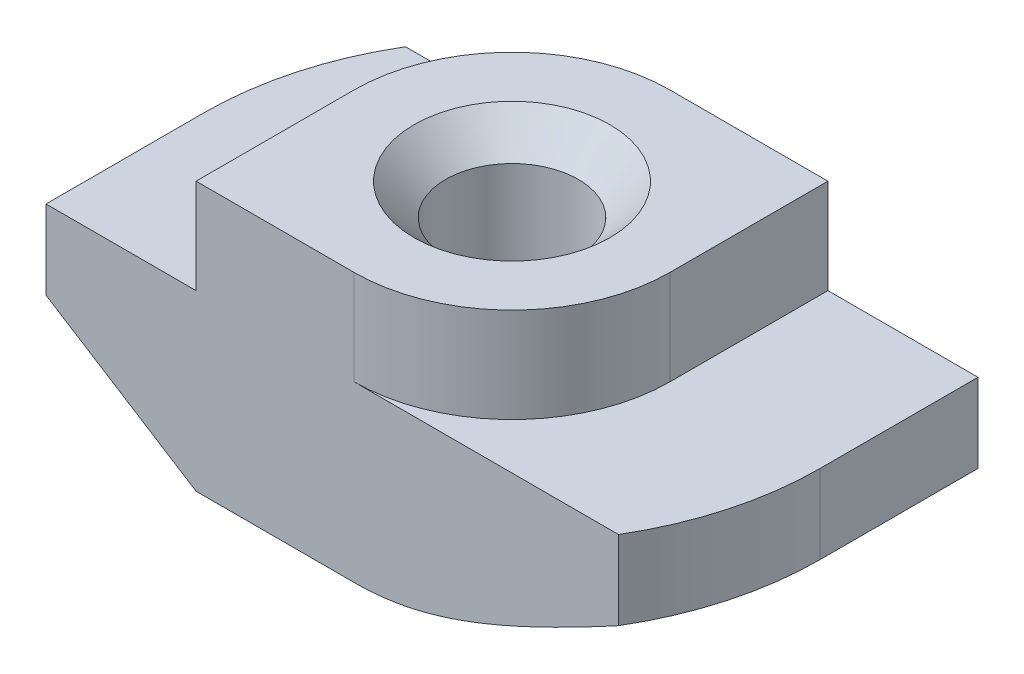
ISO-10303-21;
HEADER;
FILE_DESCRIPTION(('STEP AP214'),'2;1');
FILE_NAME('part.step','',(''),(''),'','','');
FILE_SCHEMA(('AUTOMOTIVE_DESIGN { 1 0 10303 214 1 1 1 1 }'));
ENDSEC;
DATA;
#1=APPLICATION_CONTEXT('core data for automotive mechanical design processes');
#2=APPLICATION_PROTOCOL_DEFINITION('international standard','automotive_design',2000,#1);
#3=PRODUCT_CONTEXT('',#1,'mechanical');
#4=PRODUCT('Part','Part','',(#3));
#5=PRODUCT_RELATED_PRODUCT_CATEGORY('part','',(#4));
#6=PRODUCT_DEFINITION_FORMATION('','',#4);
#7=PRODUCT_DEFINITION_CONTEXT('part definition',#1,'design');
#8=PRODUCT_DEFINITION('design','',#6,#7);
#9=PRODUCT_DEFINITION_SHAPE('','',#8);
#10=(LENGTH_UNIT() NAMED_UNIT(*) SI_UNIT(.MILLI.,.METRE.));
#11=(NAMED_UNIT(*) PLANE_ANGLE_UNIT() SI_UNIT($,.RADIAN.));
#12=(NAMED_UNIT(*) SI_UNIT($,.STERADIAN.) SOLID_ANGLE_UNIT());
#13=UNCERTAINTY_MEASURE_WITH_UNIT(LENGTH_MEASURE(1.E-05),#10,'distance_accuracy_value','');
#14=(GEOMETRIC_REPRESENTATION_CONTEXT(3) GLOBAL_UNCERTAINTY_ASSIGNED_CONTEXT((#13)) GLOBAL_UNIT_ASSIGNED_CONTEXT((#10,
#11,#12)) REPRESENTATION_CONTEXT('',''));
#15=CARTESIAN_POINT('',(0.,0.,0.));
#16=DIRECTION('',(0.,0.,1.));
#17=DIRECTION('',(1.,0.,0.));
#18=AXIS2_PLACEMENT_3D('',#15,#16,#17);
#19=CARTESIAN_POINT('',(-9.75,-3.,5.));
#20=DIRECTION('',(1.,0.,0.));
#21=DIRECTION('',(0.,1.,0.));
#22=AXIS2_PLACEMENT_3D('',#19,#20,#21);
#23=PLANE('',#22);
#24=DIRECTION('',(0.,0.,-1.));
#25=VECTOR('',#24,1.);
#26=CARTESIAN_POINT('',(-9.75,-5.5,5.));
#27=LINE('',#26,#25);
#28=CARTESIAN_POINT('',(-9.75,-5.5,5.));
#29=VERTEX_POINT('',#28);
#30=CARTESIAN_POINT('',(-9.75,-5.5,0.));
#31=VERTEX_POINT('',#30);
#32=EDGE_CURVE('E316',#29,#31,#27,.T.);
#33=ORIENTED_EDGE('',*,*,#32,.F.);
#34=DIRECTION('',(0.,-1.,0.));
#35=VECTOR('',#34,1.);
#36=CARTESIAN_POINT('',(-9.75,-3.,5.));
#37=LINE('',#36,#35);
#38=CARTESIAN_POINT('',(-9.75,-3.,5.));
#39=VERTEX_POINT('',#38);
#40=EDGE_CURVE('E163',#39,#29,#37,.T.);
#41=ORIENTED_EDGE('',*,*,#40,.F.);
#42=DIRECTION('',(0.,0.,-1.));
#43=VECTOR('',#42,1.);
#44=CARTESIAN_POINT('',(-9.75,-3.,5.));
#45=LINE('',#44,#43);
#46=CARTESIAN_POINT('',(-9.75,-3.,0.));
#47=VERTEX_POINT('',#46);
#48=EDGE_CURVE('E45',#39,#47,#45,.T.);
#49=ORIENTED_EDGE('',*,*,#48,.T.);
#50=DIRECTION('',(0.,1.,0.));
#51=VECTOR('',#50,1.);
#52=CARTESIAN_POINT('',(-9.75,-8.5,0.));
#53=LINE('',#52,#51);
#54=EDGE_CURVE('E209',#31,#47,#53,.T.);
#55=ORIENTED_EDGE('',*,*,#54,.F.);
#56=EDGE_LOOP('',(#33,#41,#49,#55));
#57=FACE_BOUND('',#56,.T.);
#58=ADVANCED_FACE('F37',(#57),#23,.F.);
#59=CARTESIAN_POINT('',(-9.75,-8.5,5.));
#60=DIRECTION('',(0.,1.,0.));
#61=DIRECTION('',(0.,0.,1.));
#62=AXIS2_PLACEMENT_3D('',#59,#60,#61);
#63=PLANE('',#62);
#64=CARTESIAN_POINT('',(0.,-8.5,0.));
#65=DIRECTION('',(0.,1.,0.));
#66=DIRECTION('',(0.,0.,1.));
#67=AXIS2_PLACEMENT_3D('',#64,#65,#66);
#68=CIRCLE('',#67,3.1);
#69=CARTESIAN_POINT('',(0.,-8.5,3.1));
#70=VERTEX_POINT('',#69);
#71=EDGE_CURVE('E258',#70,#70,#68,.T.);
#72=ORIENTED_EDGE('',*,*,#71,.T.);
#73=EDGE_LOOP('',(#72));
#74=FACE_BOUND('',#73,.T.);
#75=DIRECTION('',(1.,0.,0.));
#76=VECTOR('',#75,1.);
#77=CARTESIAN_POINT('',(-9.75,-8.5,5.));
#78=LINE('',#77,#76);
#79=CARTESIAN_POINT('',(-5.,-8.5,5.));
#80=VERTEX_POINT('',#79);
#81=CARTESIAN_POINT('',(0.,-8.5,5.));
#82=VERTEX_POINT('',#81);
#83=EDGE_CURVE('E161',#80,#82,#78,.T.);
#84=ORIENTED_EDGE('',*,*,#83,.F.);
#85=DIRECTION('',(0.,0.,-1.));
#86=VECTOR('',#85,1.);
#87=CARTESIAN_POINT('',(-5.,-8.5,5.));
#88=LINE('',#87,#86);
#89=CARTESIAN_POINT('',(-5.,-8.5,0.));
#90=VERTEX_POINT('',#89);
#91=EDGE_CURVE('E146',#80,#90,#88,.T.);
#92=ORIENTED_EDGE('',*,*,#91,.T.);
#93=CARTESIAN_POINT('',(0.,-8.5,0.));
#94=DIRECTION('',(0.,-1.,0.));
#95=DIRECTION('',(-1.,0.,0.));
#96=AXIS2_PLACEMENT_3D('',#93,#94,#95);
#97=CIRCLE('',#96,5.);
#98=CARTESIAN_POINT('',(0.,-8.5,-5.));
#99=VERTEX_POINT('',#98);
#100=EDGE_CURVE('E317',#90,#99,#97,.T.);
#101=ORIENTED_EDGE('',*,*,#100,.T.);
#102=DIRECTION('',(1.,0.,0.));
#103=VECTOR('',#102,1.);
#104=CARTESIAN_POINT('',(-9.75,-8.5,-5.));
#105=LINE('',#104,#103);
#106=CARTESIAN_POINT('',(5.,-8.5,-5.));
#107=VERTEX_POINT('',#106);
#108=EDGE_CURVE('E181',#99,#107,#105,.T.);
#109=ORIENTED_EDGE('',*,*,#108,.T.);
#110=DIRECTION('',(0.,0.,1.));
#111=VECTOR('',#110,1.);
#112=CARTESIAN_POINT('',(5.,-8.5,-9.75));
#113=LINE('',#112,#111);
#114=CARTESIAN_POINT('',(5.,-8.5,0.));
#115=VERTEX_POINT('',#114);
#116=EDGE_CURVE('E52',#107,#115,#113,.T.);
#117=ORIENTED_EDGE('',*,*,#116,.T.);
#118=CARTESIAN_POINT('',(0.,-8.5,0.));
#119=DIRECTION('',(0.,-1.,0.));
#120=DIRECTION('',(1.,0.,0.));
#121=AXIS2_PLACEMENT_3D('',#118,#119,#120);
#122=CIRCLE('',#121,5.);
#123=EDGE_CURVE('E167',#115,#82,#122,.T.);
#124=ORIENTED_EDGE('',*,*,#123,.T.);
#125=EDGE_LOOP('',(#84,#92,#101,#109,#117,#124));
#126=FACE_BOUND('',#125,.T.);
#127=ADVANCED_FACE('F166',(#74,#126),#63,.F.);
#128=CARTESIAN_POINT('',(9.75,-3.,5.));
#129=DIRECTION('',(-1.,0.,0.));
#130=DIRECTION('',(0.,-1.,0.));
#131=AXIS2_PLACEMENT_3D('',#128,#129,#130);
#132=PLANE('',#131);
#133=DIRECTION('',(0.,0.,1.));
#134=VECTOR('',#133,1.);
#135=CARTESIAN_POINT('',(9.75,-5.5,-9.75));
#136=LINE('',#135,#134);
#137=CARTESIAN_POINT('',(9.75,-5.5,-5.));
#138=VERTEX_POINT('',#137);
#139=CARTESIAN_POINT('',(9.75,-5.5,0.));
#140=VERTEX_POINT('',#139);
#141=EDGE_CURVE('E304',#138,#140,#136,.T.);
#142=ORIENTED_EDGE('',*,*,#141,.F.);
#143=DIRECTION('',(0.,1.,0.));
#144=VECTOR('',#143,1.);
#145=CARTESIAN_POINT('',(9.75,-3.,-5.));
#146=LINE('',#145,#144);
#147=CARTESIAN_POINT('',(9.75,-3.,-5.));
#148=VERTEX_POINT('',#147);
#149=EDGE_CURVE('E185',#138,#148,#146,.T.);
#150=ORIENTED_EDGE('',*,*,#149,.T.);
#151=DIRECTION('',(0.,0.,-1.));
#152=VECTOR('',#151,1.);
#153=CARTESIAN_POINT('',(9.75,-3.,5.));
#154=LINE('',#153,#152);
#155=CARTESIAN_POINT('',(9.75,-3.,0.));
#156=VERTEX_POINT('',#155);
#157=EDGE_CURVE('E203',#156,#148,#154,.T.);
#158=ORIENTED_EDGE('',*,*,#157,.F.);
#159=DIRECTION('',(0.,1.,0.));
#160=VECTOR('',#159,1.);
#161=CARTESIAN_POINT('',(9.75,-8.5,0.));
#162=LINE('',#161,#160);
#163=EDGE_CURVE('E220',#140,#156,#162,.T.);
#164=ORIENTED_EDGE('',*,*,#163,.F.);
#165=EDGE_LOOP('',(#142,#150,#158,#164));
#166=FACE_BOUND('',#165,.T.);
#167=ADVANCED_FACE('F303',(#166),#132,.F.);
#168=CARTESIAN_POINT('',(0.,0.,5.));
#169=DIRECTION('',(0.,0.,-1.));
#170=DIRECTION('',(-1.,0.,0.));
#171=AXIS2_PLACEMENT_3D('',#168,#169,#170);
#172=PLANE('',#171);
#173=DIRECTION('',(-0.845488903030971,0.533992991387982,0.));
#174=VECTOR('',#173,1.);
#175=CARTESIAN_POINT('',(-5.,-8.5,5.));
#176=LINE('',#175,#174);
#177=EDGE_CURVE('E149',#80,#29,#176,.T.);
#178=ORIENTED_EDGE('',*,*,#177,.F.);
#179=ORIENTED_EDGE('',*,*,#83,.T.);
#180=CARTESIAN_POINT('',(17.262244143281,-0.307293389432442,5.));
#181=CARTESIAN_POINT('',(16.9181308600236,-0.516038873305145,5.));
#182=CARTESIAN_POINT('',(16.5738102897848,-0.724443579056905,5.));
#183=CARTESIAN_POINT('',(15.8846572648478,-1.14040949764273,5.));
#184=CARTESIAN_POINT('',(15.5398248070583,-1.34797070535434,5.));
#185=CARTESIAN_POINT('',(14.849449183752,-1.76214855860734,5.));
#186=CARTESIAN_POINT('',(14.5039058329425,-1.96876489545256,5.));
#187=CARTESIAN_POINT('',(13.8120865339308,-2.38076637630233,5.));
#188=CARTESIAN_POINT('',(13.4658105873009,-2.58615152294555,5.));
#189=CARTESIAN_POINT('',(12.7701257444387,-2.9967235767826,5.));
#190=CARTESIAN_POINT('',(12.4207110467127,-3.20190066061248,5.));
#191=CARTESIAN_POINT('',(11.7207559725619,-3.61032570435187,5.));
#192=CARTESIAN_POINT('',(11.3702155989535,-3.81357366908299,5.));
#193=CARTESIAN_POINT('',(10.6677796822931,-4.21757158257786,5.));
#194=CARTESIAN_POINT('',(10.3158843909765,-4.41832196857919,5.));
#195=CARTESIAN_POINT('',(9.61028766235045,-4.81662297884814,5.));
#196=CARTESIAN_POINT('',(9.25658624442202,-5.01417363735639,5.));
#197=CARTESIAN_POINT('',(8.67651884482225,-5.33358875947317,5.));
#198=CARTESIAN_POINT('',(8.45085586286926,-5.45672933011883,5.));
#199=CARTESIAN_POINT('',(7.99839816596211,-5.7009118245922,5.));
#200=CARTESIAN_POINT('',(7.7716034613976,-5.82195376764063,5.));
#201=CARTESIAN_POINT('',(7.31656550307167,-6.06150930978857,5.));
#202=CARTESIAN_POINT('',(7.08832171147009,-6.18002188913812,5.));
#203=CARTESIAN_POINT('',(6.63019586788231,-6.4138387855286,5.));
#204=CARTESIAN_POINT('',(6.40031383435597,-6.52914313864854,5.));
#205=CARTESIAN_POINT('',(5.93820478281431,-6.75588727170323,5.));
#206=CARTESIAN_POINT('',(5.7059746936284,-6.86732081363046,5.));
#207=CARTESIAN_POINT('',(5.23907645564551,-7.08502278555658,5.));
#208=CARTESIAN_POINT('',(5.00440814785845,-7.19129087613112,5.));
#209=CARTESIAN_POINT('',(4.53226065346344,-7.39709096715067,5.));
#210=CARTESIAN_POINT('',(4.29478297028451,-7.49662639457186,5.));
#211=CARTESIAN_POINT('',(3.81637192229998,-7.68696585333208,5.));
#212=CARTESIAN_POINT('',(3.5754391700731,-7.77777141099744,5.));
#213=CARTESIAN_POINT('',(3.0666504277393,-7.95599282874955,5.));
#214=CARTESIAN_POINT('',(2.79839541579213,-8.04228449542548,5.));
#215=CARTESIAN_POINT('',(2.2565574894892,-8.19664810960895,5.));
#216=CARTESIAN_POINT('',(1.98297506296302,-8.26472171700009,5.));
#217=CARTESIAN_POINT('',(1.57048018943482,-8.34889725118016,5.));
#218=CARTESIAN_POINT('',(1.43336340824762,-8.37388041638201,5.));
#219=CARTESIAN_POINT('',(1.15813012493196,-8.41748641658561,5.));
#220=CARTESIAN_POINT('',(1.02001377745311,-8.436110214877,5.));
#221=CARTESIAN_POINT('',(0.743060652147379,-8.46647997898083,5.));
#222=CARTESIAN_POINT('',(0.604224087141818,-8.47822787147193,5.));
#223=CARTESIAN_POINT('',(0.326124948003932,-8.49449788273713,5.));
#224=CARTESIAN_POINT('',(0.186862377229114,-8.4990200583135,5.));
#225=CARTESIAN_POINT('',(-0.0922407847681702,-8.50069722270995,5.));
#226=CARTESIAN_POINT('',(-0.232081548334554,-8.49782394939686,5.));
#227=CARTESIAN_POINT('',(-0.511416983097128,-8.48474358023713,5.));
#228=CARTESIAN_POINT('',(-0.650911651522947,-8.47453642587413,5.));
#229=CARTESIAN_POINT('',(-0.929240782372286,-8.44710081868491,5.));
#230=CARTESIAN_POINT('',(-1.06807506182894,-8.42987052298589,5.));
#231=CARTESIAN_POINT('',(-1.34478468003669,-8.38888095808797,5.));
#232=CARTESIAN_POINT('',(-1.48265986658218,-8.36512067578682,5.));
#233=CARTESIAN_POINT('',(-1.89959043169188,-8.28395489226572,5.));
#234=CARTESIAN_POINT('',(-2.17684565694345,-8.21720360210331,5.));
#235=CARTESIAN_POINT('',(-2.72589170638494,-8.06457588389501,5.));
#236=CARTESIAN_POINT('',(-2.99768197912353,-7.97869753625189,5.));
#237=CARTESIAN_POINT('',(-3.51935741319823,-7.79847300649859,5.));
#238=CARTESIAN_POINT('',(-3.76954704201942,-7.70499615425147,5.));
#239=CARTESIAN_POINT('',(-4.26618103118316,-7.50852092270228,5.));
#240=CARTESIAN_POINT('',(-4.51262461455279,-7.40552059867213,5.));
#241=CARTESIAN_POINT('',(-5.00262192827966,-7.19219327582968,5.));
#242=CARTESIAN_POINT('',(-5.24617216747364,-7.08185831308792,5.));
#243=CARTESIAN_POINT('',(-5.73065462411407,-6.85565949095677,5.));
#244=CARTESIAN_POINT('',(-5.97158705304315,-6.73979608232788,5.));
#245=CARTESIAN_POINT('',(-6.43818954732616,-6.5102320811199,5.));
#246=CARTESIAN_POINT('',(-6.66397276848694,-6.39676061738702,5.));
#247=CARTESIAN_POINT('',(-7.11397427522263,-6.16674600104322,5.));
#248=CARTESIAN_POINT('',(-7.33819251414361,-6.05020275734948,5.));
#249=CARTESIAN_POINT('',(-7.78462128962769,-5.81501515861086,5.));
#250=CARTESIAN_POINT('',(-8.00683592168321,-5.69637855963136,5.));
#251=CARTESIAN_POINT('',(-8.45015187326331,-5.45708859393409,5.));
#252=CARTESIAN_POINT('',(-8.67125329033443,-5.3364354080695,5.));
#253=CARTESIAN_POINT('',(-8.89190962188937,-5.21498281447114,5.));
#254=B_SPLINE_CURVE_WITH_KNOTS('',3,(#180,#181,#182,#183,#184,#185,#186,#187,#188,#189,#190,
#191,#192,#193,#194,#195,#196,#197,#198,#199,#200,#201,#202,#203,#204,#205,#206,#207,#208,#209,
#210,#211,#212,#213,#214,#215,#216,#217,#218,#219,#220,#221,#222,#223,#224,#225,#226,#227,#228,
#229,#230,#231,#232,#233,#234,#235,#236,#237,#238,#239,#240,#241,#242,#243,#244,#245,#246,#247,
#248,#249,#250,#251,#252,#253),.UNSPECIFIED.,.F.,.F.,(4,2,2,2,2,2,2,2,2,2,2,2,2,2,2,2,2,2,2,2,2,
2,2,2,2,2,2,2,2,2,2,2,2,2,2,2,4),(0.,1.2074348525902,2.41487702685636,3.6226889318846,
4.83049824742936,6.04609801107066,7.26169473565424,8.47707556989018,9.6924433896013,
10.4636587366001,11.2348670165302,12.0063805610561,12.7778854258001,13.5505808046002,
14.3233268891437,15.0956766332549,15.8678910935751,16.712814547319,17.5576609921784,
17.9756593894318,18.3935944419621,18.8114123299238,19.2292269333493,19.6486406079805,
20.0680576291127,20.4875847762243,20.9071770481351,21.7617047407382,22.6163182326723,
23.4173126374625,24.2184709710381,25.0205138758327,25.8224914976274,26.5805429248652,
27.3386168547938,28.0943078892628,28.8499315110688),.UNSPECIFIED.);
#255=CARTESIAN_POINT('',(8.3703345213916,-5.5,5.));
#256=VERTEX_POINT('',#255);
#257=EDGE_CURVE('E321',#256,#82,#254,.T.);
#258=ORIENTED_EDGE('',*,*,#257,.F.);
#259=DIRECTION('',(0.,1.,0.));
#260=VECTOR('',#259,1.);
#261=CARTESIAN_POINT('',(8.37033452139161,-8.5,5.));
#262=LINE('',#261,#260);
#263=CARTESIAN_POINT('',(8.37033452139161,-3.,5.));
#264=VERTEX_POINT('',#263);
#265=EDGE_CURVE('E223',#256,#264,#262,.T.);
#266=ORIENTED_EDGE('',*,*,#265,.T.);
#267=DIRECTION('',(-1.,0.,0.));
#268=VECTOR('',#267,1.);
#269=CARTESIAN_POINT('',(5.,-3.,5.));
#270=LINE('',#269,#268);
#271=CARTESIAN_POINT('',(0.,-3.,5.));
#272=VERTEX_POINT('',#271);
#273=EDGE_CURVE('E168',#264,#272,#270,.T.);
#274=ORIENTED_EDGE('',*,*,#273,.T.);
#275=DIRECTION('',(0.,1.,0.));
#276=VECTOR('',#275,1.);
#277=CARTESIAN_POINT('',(0.,-10.0710678118655,5.));
#278=LINE('',#277,#276);
#279=CARTESIAN_POINT('',(0.,0.,5.));
#280=VERTEX_POINT('',#279);
#281=EDGE_CURVE('E246',#272,#280,#278,.T.);
#282=ORIENTED_EDGE('',*,*,#281,.T.);
#283=DIRECTION('',(-1.,0.,0.));
#284=VECTOR('',#283,1.);
#285=CARTESIAN_POINT('',(5.,0.,5.));
#286=LINE('',#285,#284);
#287=CARTESIAN_POINT('',(-5.,0.,5.));
#288=VERTEX_POINT('',#287);
#289=EDGE_CURVE('E170',#280,#288,#286,.T.);
#290=ORIENTED_EDGE('',*,*,#289,.T.);
#291=DIRECTION('',(0.,-1.,0.));
#292=VECTOR('',#291,1.);
#293=CARTESIAN_POINT('',(-5.,0.,5.));
#294=LINE('',#293,#292);
#295=CARTESIAN_POINT('',(-5.,-3.,5.));
#296=VERTEX_POINT('',#295);
#297=EDGE_CURVE('E196',#288,#296,#294,.T.);
#298=ORIENTED_EDGE('',*,*,#297,.T.);
#299=DIRECTION('',(-1.,0.,0.));
#300=VECTOR('',#299,1.);
#301=CARTESIAN_POINT('',(-5.,-3.,5.));
#302=LINE('',#301,#300);
#303=EDGE_CURVE('E172',#296,#39,#302,.T.);
#304=ORIENTED_EDGE('',*,*,#303,.T.);
#305=ORIENTED_EDGE('',*,*,#40,.T.);
#306=EDGE_LOOP('',(#178,#179,#258,#266,#274,#282,#290,#298,#304,#305));
#307=FACE_BOUND('',#306,.T.);
#308=ADVANCED_FACE('F159',(#307),#172,.F.);
#309=CARTESIAN_POINT('',(0.,0.,-5.));
#310=DIRECTION('',(0.,0.,-1.));
#311=DIRECTION('',(-1.,0.,0.));
#312=AXIS2_PLACEMENT_3D('',#309,#310,#311);
#313=PLANE('',#312);
#314=ORIENTED_EDGE('',*,*,#108,.F.);
#315=CARTESIAN_POINT('',(8.89190962188937,-5.21498281447114,-5.));
#316=CARTESIAN_POINT('',(8.69807179539359,-5.32168067117576,-5.));
#317=CARTESIAN_POINT('',(8.50388785728022,-5.42775496118508,-5.));
#318=CARTESIAN_POINT('',(8.1146877622672,-5.63838122911741,-5.));
#319=CARTESIAN_POINT('',(7.91967157637704,-5.7429331534413,-5.));
#320=CARTESIAN_POINT('',(7.52839888713611,-5.95038133144811,-5.));
#321=CARTESIAN_POINT('',(7.33214100146388,-6.05327498229202,-5.));
#322=CARTESIAN_POINT('',(6.93849540288173,-6.25688093934329,-5.));
#323=CARTESIAN_POINT('',(6.74110769028751,-6.3575932461601,-5.));
#324=CARTESIAN_POINT('',(6.3357672159849,-6.56100584407135,-5.));
#325=CARTESIAN_POINT('',(6.12775094383909,-6.66357990091405,-5.));
#326=CARTESIAN_POINT('',(5.70998529557087,-6.86514027333031,-5.));
#327=CARTESIAN_POINT('',(5.50023593777036,-6.96412662677306,-5.));
#328=CARTESIAN_POINT('',(5.07876792598832,-7.15757127235479,-5.));
#329=CARTESIAN_POINT('',(4.86705023469105,-7.25203165193533,-5.));
#330=CARTESIAN_POINT('',(4.44118238119509,-7.43528919122207,-5.));
#331=CARTESIAN_POINT('',(4.22703233985032,-7.52408663085993,-5.));
#332=CARTESIAN_POINT('',(3.74385288468483,-7.71506163103555,-5.));
#333=CARTESIAN_POINT('',(3.47404603839998,-7.81530000006557,-5.));
#334=CARTESIAN_POINT('',(2.92922404134082,-8.00085532819617,-5.));
#335=CARTESIAN_POINT('',(2.6542079386462,-8.08616953037964,-5.));
#336=CARTESIAN_POINT('',(2.10323036092006,-8.2355227100339,-5.));
#337=CARTESIAN_POINT('',(1.82736219174236,-8.29989467604697,-5.));
#338=CARTESIAN_POINT('',(1.4101978310497,-8.37787726350092,-5.));
#339=CARTESIAN_POINT('',(1.27061787891269,-8.40077217403349,-5.));
#340=CARTESIAN_POINT('',(0.990522379503271,-8.43978497345868,-5.));
#341=CARTESIAN_POINT('',(0.850006980711086,-8.45590391299746,-5.));
#342=CARTESIAN_POINT('',(0.565328569476554,-8.48115186670237,-5.));
#343=CARTESIAN_POINT('',(0.421151583542625,-8.49012478020239,-5.));
#344=CARTESIAN_POINT('',(0.132539112730267,-8.50020136367205,-5.));
#345=CARTESIAN_POINT('',(-0.0118963351057367,-8.50130608305248,-5.));
#346=CARTESIAN_POINT('',(-0.300615839300795,-8.49561054776519,-5.));
#347=CARTESIAN_POINT('',(-0.444899888884881,-8.48880995327448,-5.));
#348=CARTESIAN_POINT('',(-0.732898629950691,-8.46753431331152,-5.));
#349=CARTESIAN_POINT('',(-0.876613307528637,-8.45305908157811,-5.));
#350=CARTESIAN_POINT('',(-1.16451937665646,-8.41671855383272,-5.));
#351=CARTESIAN_POINT('',(-1.30870177468433,-8.39478264310604,-5.));
#352=CARTESIAN_POINT('',(-1.59588471177897,-8.34419166821339,-5.));
#353=CARTESIAN_POINT('',(-1.73888515141359,-8.31553604458982,-5.));
#354=CARTESIAN_POINT('',(-2.02358463369644,-8.25221795864572,-5.));
#355=CARTESIAN_POINT('',(-2.16528327980946,-8.21755372603012,-5.));
#356=CARTESIAN_POINT('',(-2.44727277130383,-8.14295776240236,-5.));
#357=CARTESIAN_POINT('',(-2.58756365220683,-8.10302616466134,-5.));
#358=CARTESIAN_POINT('',(-2.927338724847,-8.0002726410662,-5.));
#359=CARTESIAN_POINT('',(-3.12609221591402,-7.93503691060338,-5.));
#360=CARTESIAN_POINT('',(-3.52096210701494,-7.79698222477459,-5.));
#361=CARTESIAN_POINT('',(-3.71707797307315,-7.72416175924735,-5.));
#362=CARTESIAN_POINT('',(-4.10708618196062,-7.57237690861237,-5.));
#363=CARTESIAN_POINT('',(-4.3009766096039,-7.49340762920191,-5.));
#364=CARTESIAN_POINT('',(-4.6866661338769,-7.33057513990394,-5.));
#365=CARTESIAN_POINT('',(-4.87846536352017,-7.24671224346253,-5.));
#366=CARTESIAN_POINT('',(-5.2607772593493,-7.07480224612794,-5.));
#367=CARTESIAN_POINT('',(-5.4512852403128,-6.98674476181852,-5.));
#368=CARTESIAN_POINT('',(-5.83076905474579,-6.80738201092531,-5.));
#369=CARTESIAN_POINT('',(-6.01974483535833,-6.71607663287805,-5.));
#370=CARTESIAN_POINT('',(-6.58454713908627,-6.43827749032946,-5.));
#371=CARTESIAN_POINT('',(-6.95842335536811,-6.24782078764797,-5.));
#372=CARTESIAN_POINT('',(-7.70515742488139,-5.85818779711648,-5.));
#373=CARTESIAN_POINT('',(-8.07798641398966,-5.65895665273319,-5.));
#374=CARTESIAN_POINT('',(-8.82080321981212,-5.2552033688582,-5.));
#375=CARTESIAN_POINT('',(-9.19079078800562,-5.05068077324098,-5.));
#376=CARTESIAN_POINT('',(-9.92800640083409,-4.63809357113866,-5.));
#377=CARTESIAN_POINT('',(-10.29523790102,-4.43003512218061,-5.));
#378=CARTESIAN_POINT('',(-11.0280229788243,-4.01101145190697,-5.));
#379=CARTESIAN_POINT('',(-11.3935766017493,-3.80004630970179,-5.));
#380=CARTESIAN_POINT('',(-12.2228494781368,-3.31806355804453,-5.));
#381=CARTESIAN_POINT('',(-12.6861650743858,-3.04635210462268,-5.));
#382=CARTESIAN_POINT('',(-13.6114053897672,-2.50014341269301,-5.));
#383=CARTESIAN_POINT('',(-14.0733294596121,-2.22564507603178,-5.));
#384=CARTESIAN_POINT('',(-14.9903643529218,-1.67796879648898,-5.));
#385=CARTESIAN_POINT('',(-15.4454897918055,-1.40481530279485,-5.));
#386=CARTESIAN_POINT('',(-16.3546077462169,-0.857062812640609,-5.));
#387=CARTESIAN_POINT('',(-16.8086006597524,-0.582464476988671,-5.));
#388=CARTESIAN_POINT('',(-17.262244143281,-0.307293389432445,-5.));
#389=B_SPLINE_CURVE_WITH_KNOTS('',3,(#315,#316,#317,#318,#319,#320,#321,#322,#323,#324,#325,
#326,#327,#328,#329,#330,#331,#332,#333,#334,#335,#336,#337,#338,#339,#340,#341,#342,#343,#344,
#345,#346,#347,#348,#349,#350,#351,#352,#353,#354,#355,#356,#357,#358,#359,#360,#361,#362,#363,
#364,#365,#366,#367,#368,#369,#370,#371,#372,#373,#374,#375,#376,#377,#378,#379,#380,#381,#382,
#383,#384,#385,#386,#387,#388),.UNSPECIFIED.,.F.,.F.,(4,2,2,2,2,2,2,2,2,2,2,2,2,2,2,2,2,2,2,2,2,
2,2,2,2,2,2,2,2,2,2,2,2,2,2,2,4),(0.,0.663793087551966,1.32760948954786,1.99238242300439,
2.65715517073158,3.35292173371489,4.04868095055264,4.74411612233015,5.43951689051758,
6.30265939462683,7.16596117765935,8.01477619153837,8.43897242720581,8.86310286497019,
9.29626188046449,9.72936312282145,10.1624829834396,10.5956133562287,11.0329629501478,
11.4703489690564,11.9078640731688,12.3453681097069,12.9727207083369,13.6001984558662,
14.2281808687188,14.8561231020818,15.4857099520211,16.115318429447,17.3739591861229,
18.6420768889435,19.9103042707088,21.1765125465911,22.4426864283525,24.054007297902,
25.665989850327,27.2583959045239,28.8501279099315),.UNSPECIFIED.);
#390=CARTESIAN_POINT('',(-8.3703345213916,-5.5,-5.));
#391=VERTEX_POINT('',#390);
#392=EDGE_CURVE('E227',#99,#391,#389,.T.);
#393=ORIENTED_EDGE('',*,*,#392,.T.);
#394=DIRECTION('',(0.,1.,0.));
#395=VECTOR('',#394,1.);
#396=CARTESIAN_POINT('',(-8.3703345213916,-8.5,-5.));
#397=LINE('',#396,#395);
#398=CARTESIAN_POINT('',(-8.3703345213916,-3.,-5.));
#399=VERTEX_POINT('',#398);
#400=EDGE_CURVE('E219',#391,#399,#397,.T.);
#401=ORIENTED_EDGE('',*,*,#400,.T.);
#402=DIRECTION('',(-1.,0.,0.));
#403=VECTOR('',#402,1.);
#404=CARTESIAN_POINT('',(-5.,-3.,-5.));
#405=LINE('',#404,#403);
#406=CARTESIAN_POINT('',(0.,-3.,-5.));
#407=VERTEX_POINT('',#406);
#408=EDGE_CURVE('E178',#407,#399,#405,.T.);
#409=ORIENTED_EDGE('',*,*,#408,.F.);
#410=DIRECTION('',(0.,1.,0.));
#411=VECTOR('',#410,1.);
#412=CARTESIAN_POINT('',(0.,-10.0710678118655,-5.));
#413=LINE('',#412,#411);
#414=CARTESIAN_POINT('',(0.,0.,-5.));
#415=VERTEX_POINT('',#414);
#416=EDGE_CURVE('E255',#407,#415,#413,.T.);
#417=ORIENTED_EDGE('',*,*,#416,.T.);
#418=DIRECTION('',(-1.,0.,0.));
#419=VECTOR('',#418,1.);
#420=CARTESIAN_POINT('',(5.,0.,-5.));
#421=LINE('',#420,#419);
#422=CARTESIAN_POINT('',(5.,0.,-5.));
#423=VERTEX_POINT('',#422);
#424=EDGE_CURVE('E193',#423,#415,#421,.T.);
#425=ORIENTED_EDGE('',*,*,#424,.F.);
#426=DIRECTION('',(0.,1.,0.));
#427=VECTOR('',#426,1.);
#428=CARTESIAN_POINT('',(5.,0.,-5.));
#429=LINE('',#428,#427);
#430=CARTESIAN_POINT('',(5.,-3.,-5.));
#431=VERTEX_POINT('',#430);
#432=EDGE_CURVE('E190',#431,#423,#429,.T.);
#433=ORIENTED_EDGE('',*,*,#432,.F.);
#434=DIRECTION('',(-1.,0.,0.));
#435=VECTOR('',#434,1.);
#436=CARTESIAN_POINT('',(5.,-3.,-5.));
#437=LINE('',#436,#435);
#438=EDGE_CURVE('E187',#148,#431,#437,.T.);
#439=ORIENTED_EDGE('',*,*,#438,.F.);
#440=ORIENTED_EDGE('',*,*,#149,.F.);
#441=DIRECTION('',(-0.845488903030971,-0.533992991387982,0.));
#442=VECTOR('',#441,1.);
#443=CARTESIAN_POINT('',(5.26336633663366,-8.33366336633664,-5.));
#444=LINE('',#443,#442);
#445=EDGE_CURVE('E313',#138,#107,#444,.T.);
#446=ORIENTED_EDGE('',*,*,#445,.T.);
#447=EDGE_LOOP('',(#314,#393,#401,#409,#417,#425,#433,#439,#440,#446));
#448=FACE_BOUND('',#447,.T.);
#449=ADVANCED_FACE('F283',(#448),#313,.T.);
#450=CARTESIAN_POINT('',(0.,-8.5,0.));
#451=DIRECTION('',(0.,1.,0.));
#452=DIRECTION('',(-1.,0.,0.));
#453=AXIS2_PLACEMENT_3D('',#450,#451,#452);
#454=CYLINDRICAL_SURFACE('',#453,9.75);
#455=CARTESIAN_POINT('',(0.,-5.5,0.));
#456=DIRECTION('',(0.,-1.,0.));
#457=DIRECTION('',(-1.,0.,0.));
#458=AXIS2_PLACEMENT_3D('',#455,#456,#457);
#459=CIRCLE('',#458,9.75);
#460=EDGE_CURVE('E60',#31,#391,#459,.T.);
#461=ORIENTED_EDGE('',*,*,#460,.F.);
#462=ORIENTED_EDGE('',*,*,#54,.T.);
#463=CARTESIAN_POINT('',(0.,-3.,0.));
#464=DIRECTION('',(0.,-1.,0.));
#465=DIRECTION('',(-1.,0.,0.));
#466=AXIS2_PLACEMENT_3D('',#463,#464,#465);
#467=CIRCLE('',#466,9.75);
#468=EDGE_CURVE('E215',#47,#399,#467,.T.);
#469=ORIENTED_EDGE('',*,*,#468,.T.);
#470=ORIENTED_EDGE('',*,*,#400,.F.);
#471=EDGE_LOOP('',(#461,#462,#469,#470));
#472=FACE_BOUND('',#471,.T.);
#473=ADVANCED_FACE('F344',(#472),#454,.T.);
#474=CARTESIAN_POINT('',(0.,-8.5,0.));
#475=DIRECTION('',(0.,1.,0.));
#476=DIRECTION('',(-1.,0.,0.));
#477=AXIS2_PLACEMENT_3D('',#474,#475,#476);
#478=CYLINDRICAL_SURFACE('',#477,9.75);
#479=CARTESIAN_POINT('',(0.,-5.5,0.));
#480=DIRECTION('',(0.,-1.,0.));
#481=DIRECTION('',(1.,0.,0.));
#482=AXIS2_PLACEMENT_3D('',#479,#480,#481);
#483=CIRCLE('',#482,9.75);
#484=EDGE_CURVE('E309',#140,#256,#483,.T.);
#485=ORIENTED_EDGE('',*,*,#484,.F.);
#486=ORIENTED_EDGE('',*,*,#163,.T.);
#487=CARTESIAN_POINT('',(0.,-3.,0.));
#488=DIRECTION('',(0.,-1.,0.));
#489=DIRECTION('',(1.,0.,0.));
#490=AXIS2_PLACEMENT_3D('',#487,#488,#489);
#491=CIRCLE('',#490,9.75);
#492=EDGE_CURVE('E237',#156,#264,#491,.T.);
#493=ORIENTED_EDGE('',*,*,#492,.T.);
#494=ORIENTED_EDGE('',*,*,#265,.F.);
#495=EDGE_LOOP('',(#485,#486,#493,#494));
#496=FACE_BOUND('',#495,.T.);
#497=ADVANCED_FACE('F347',(#496),#478,.T.);
#498=CARTESIAN_POINT('',(-5.,0.,5.));
#499=DIRECTION('',(1.,0.,0.));
#500=DIRECTION('',(0.,0.,-1.));
#501=AXIS2_PLACEMENT_3D('',#498,#499,#500);
#502=PLANE('',#501);
#503=DIRECTION('',(0.,0.,-1.));
#504=VECTOR('',#503,1.);
#505=CARTESIAN_POINT('',(-5.,0.,5.));
#506=LINE('',#505,#504);
#507=CARTESIAN_POINT('',(-5.,0.,0.));
#508=VERTEX_POINT('',#507);
#509=EDGE_CURVE('E177',#288,#508,#506,.T.);
#510=ORIENTED_EDGE('',*,*,#509,.T.);
#511=DIRECTION('',(0.,1.,0.));
#512=VECTOR('',#511,1.);
#513=CARTESIAN_POINT('',(-5.,-10.0710678118655,0.));
#514=LINE('',#513,#512);
#515=CARTESIAN_POINT('',(-5.,-3.,0.));
#516=VERTEX_POINT('',#515);
#517=EDGE_CURVE('E252',#516,#508,#514,.T.);
#518=ORIENTED_EDGE('',*,*,#517,.F.);
#519=DIRECTION('',(0.,0.,-1.));
#520=VECTOR('',#519,1.);
#521=CARTESIAN_POINT('',(-5.,-3.,5.));
#522=LINE('',#521,#520);
#523=EDGE_CURVE('E11',#296,#516,#522,.T.);
#524=ORIENTED_EDGE('',*,*,#523,.F.);
#525=ORIENTED_EDGE('',*,*,#297,.F.);
#526=EDGE_LOOP('',(#510,#518,#524,#525));
#527=FACE_BOUND('',#526,.T.);
#528=ADVANCED_FACE('F39',(#527),#502,.F.);
#529=CARTESIAN_POINT('',(-5.,-3.,5.));
#530=DIRECTION('',(0.,-1.,0.));
#531=DIRECTION('',(1.,0.,0.));
#532=AXIS2_PLACEMENT_3D('',#529,#530,#531);
#533=PLANE('',#532);
#534=ORIENTED_EDGE('',*,*,#408,.T.);
#535=ORIENTED_EDGE('',*,*,#468,.F.);
#536=ORIENTED_EDGE('',*,*,#48,.F.);
#537=ORIENTED_EDGE('',*,*,#303,.F.);
#538=ORIENTED_EDGE('',*,*,#523,.T.);
#539=CARTESIAN_POINT('',(0.,-3.,0.));
#540=DIRECTION('',(0.,-1.,0.));
#541=DIRECTION('',(1.,0.,0.));
#542=AXIS2_PLACEMENT_3D('',#539,#540,#541);
#543=CIRCLE('',#542,5.);
#544=EDGE_CURVE('E253',#516,#407,#543,.T.);
#545=ORIENTED_EDGE('',*,*,#544,.T.);
#546=EDGE_LOOP('',(#534,#535,#536,#537,#538,#545));
#547=FACE_BOUND('',#546,.T.);
#548=ADVANCED_FACE('F212',(#547),#533,.F.);
#549=CARTESIAN_POINT('',(5.,-3.,5.));
#550=DIRECTION('',(0.,-1.,0.));
#551=DIRECTION('',(1.,0.,0.));
#552=AXIS2_PLACEMENT_3D('',#549,#550,#551);
#553=PLANE('',#552);
#554=ORIENTED_EDGE('',*,*,#273,.F.);
#555=ORIENTED_EDGE('',*,*,#492,.F.);
#556=ORIENTED_EDGE('',*,*,#157,.T.);
#557=ORIENTED_EDGE('',*,*,#438,.T.);
#558=DIRECTION('',(0.,0.,-1.));
#559=VECTOR('',#558,1.);
#560=CARTESIAN_POINT('',(5.,-3.,5.));
#561=LINE('',#560,#559);
#562=CARTESIAN_POINT('',(5.,-3.,0.));
#563=VERTEX_POINT('',#562);
#564=EDGE_CURVE('E201',#563,#431,#561,.T.);
#565=ORIENTED_EDGE('',*,*,#564,.F.);
#566=CARTESIAN_POINT('',(0.,-3.,0.));
#567=DIRECTION('',(0.,-1.,0.));
#568=DIRECTION('',(1.,0.,0.));
#569=AXIS2_PLACEMENT_3D('',#566,#567,#568);
#570=CIRCLE('',#569,5.);
#571=EDGE_CURVE('E243',#563,#272,#570,.T.);
#572=ORIENTED_EDGE('',*,*,#571,.T.);
#573=EDGE_LOOP('',(#554,#555,#556,#557,#565,#572));
#574=FACE_BOUND('',#573,.T.);
#575=ADVANCED_FACE('F297',(#574),#553,.F.);
#576=CARTESIAN_POINT('',(5.,0.,5.));
#577=DIRECTION('',(-1.,0.,0.));
#578=DIRECTION('',(0.,0.,1.));
#579=AXIS2_PLACEMENT_3D('',#576,#577,#578);
#580=PLANE('',#579);
#581=DIRECTION('',(0.,0.,-1.));
#582=VECTOR('',#581,1.);
#583=CARTESIAN_POINT('',(5.,0.,5.));
#584=LINE('',#583,#582);
#585=CARTESIAN_POINT('',(5.,0.,0.));
#586=VERTEX_POINT('',#585);
#587=EDGE_CURVE('E199',#586,#423,#584,.T.);
#588=ORIENTED_EDGE('',*,*,#587,.F.);
#589=DIRECTION('',(0.,1.,0.));
#590=VECTOR('',#589,1.);
#591=CARTESIAN_POINT('',(5.,-10.0710678118655,0.));
#592=LINE('',#591,#590);
#593=EDGE_CURVE('E242',#563,#586,#592,.T.);
#594=ORIENTED_EDGE('',*,*,#593,.F.);
#595=ORIENTED_EDGE('',*,*,#564,.T.);
#596=ORIENTED_EDGE('',*,*,#432,.T.);
#597=EDGE_LOOP('',(#588,#594,#595,#596));
#598=FACE_BOUND('',#597,.T.);
#599=ADVANCED_FACE('F291',(#598),#580,.F.);
#600=CARTESIAN_POINT('',(5.,0.,5.));
#601=DIRECTION('',(0.,-1.,0.));
#602=DIRECTION('',(0.,0.,-1.));
#603=AXIS2_PLACEMENT_3D('',#600,#601,#602);
#604=PLANE('',#603);
#605=CARTESIAN_POINT('',(0.,0.,0.));
#606=DIRECTION('',(0.,1.,0.));
#607=DIRECTION('',(0.,0.,1.));
#608=AXIS2_PLACEMENT_3D('',#605,#606,#607);
#609=CIRCLE('',#608,3.1);
#610=CARTESIAN_POINT('',(0.,0.,3.1));
#611=VERTEX_POINT('',#610);
#612=EDGE_CURVE('E262',#611,#611,#609,.T.);
#613=ORIENTED_EDGE('',*,*,#612,.F.);
#614=EDGE_LOOP('',(#613));
#615=FACE_BOUND('',#614,.T.);
#616=ORIENTED_EDGE('',*,*,#289,.F.);
#617=CARTESIAN_POINT('',(0.,0.,0.));
#618=DIRECTION('',(0.,-1.,0.));
#619=DIRECTION('',(0.,0.,-1.));
#620=AXIS2_PLACEMENT_3D('',#617,#618,#619);
#621=CIRCLE('',#620,5.);
#622=EDGE_CURVE('E235',#586,#280,#621,.T.);
#623=ORIENTED_EDGE('',*,*,#622,.F.);
#624=ORIENTED_EDGE('',*,*,#587,.T.);
#625=ORIENTED_EDGE('',*,*,#424,.T.);
#626=CARTESIAN_POINT('',(0.,0.,0.));
#627=DIRECTION('',(0.,-1.,0.));
#628=DIRECTION('',(0.,0.,-1.));
#629=AXIS2_PLACEMENT_3D('',#626,#627,#628);
#630=CIRCLE('',#629,5.);
#631=EDGE_CURVE('E250',#508,#415,#630,.T.);
#632=ORIENTED_EDGE('',*,*,#631,.F.);
#633=ORIENTED_EDGE('',*,*,#509,.F.);
#634=EDGE_LOOP('',(#616,#623,#624,#625,#632,#633));
#635=FACE_BOUND('',#634,.T.);
#636=ADVANCED_FACE('F286',(#615,#635),#604,.F.);
#637=CARTESIAN_POINT('',(0.,-7.5,0.));
#638=DIRECTION('',(0.,-1.,0.));
#639=DIRECTION('',(0.,0.,-1.));
#640=AXIS2_PLACEMENT_3D('',#637,#638,#639);
#641=CONICAL_SURFACE('',#640,2.1,0.785398163397447);
#642=ORIENTED_EDGE('',*,*,#71,.F.);
#643=EDGE_LOOP('',(#642));
#644=FACE_BOUND('',#643,.T.);
#645=CARTESIAN_POINT('',(0.,-7.5,0.));
#646=DIRECTION('',(0.,1.,0.));
#647=DIRECTION('',(0.,0.,1.));
#648=AXIS2_PLACEMENT_3D('',#645,#646,#647);
#649=CIRCLE('',#648,2.1);
#650=CARTESIAN_POINT('',(0.,-7.5,2.1));
#651=VERTEX_POINT('',#650);
#652=EDGE_CURVE('E182',#651,#651,#649,.T.);
#653=ORIENTED_EDGE('',*,*,#652,.T.);
#654=EDGE_LOOP('',(#653));
#655=FACE_BOUND('',#654,.T.);
#656=ADVANCED_FACE('F362',(#644,#655),#641,.F.);
#657=CARTESIAN_POINT('',(0.,0.,0.));
#658=DIRECTION('',(0.,1.,0.));
#659=DIRECTION('',(0.,0.,1.));
#660=AXIS2_PLACEMENT_3D('',#657,#658,#659);
#661=CYLINDRICAL_SURFACE('',#660,2.1);
#662=ORIENTED_EDGE('',*,*,#652,.F.);
#663=EDGE_LOOP('',(#662));
#664=FACE_BOUND('',#663,.T.);
#665=CARTESIAN_POINT('',(0.,-1.,0.));
#666=DIRECTION('',(0.,1.,0.));
#667=DIRECTION('',(0.,0.,1.));
#668=AXIS2_PLACEMENT_3D('',#665,#666,#667);
#669=CIRCLE('',#668,2.1);
#670=CARTESIAN_POINT('',(0.,-1.,2.1));
#671=VERTEX_POINT('',#670);
#672=EDGE_CURVE('E265',#671,#671,#669,.T.);
#673=ORIENTED_EDGE('',*,*,#672,.T.);
#674=EDGE_LOOP('',(#673));
#675=FACE_BOUND('',#674,.T.);
#676=ADVANCED_FACE('F359',(#664,#675),#661,.F.);
#677=CARTESIAN_POINT('',(0.,0.,0.));
#678=DIRECTION('',(0.,1.,0.));
#679=DIRECTION('',(0.,0.,1.));
#680=AXIS2_PLACEMENT_3D('',#677,#678,#679);
#681=CONICAL_SURFACE('',#680,3.1,0.785398163397448);
#682=ORIENTED_EDGE('',*,*,#672,.F.);
#683=EDGE_LOOP('',(#682));
#684=FACE_BOUND('',#683,.T.);
#685=ORIENTED_EDGE('',*,*,#612,.T.);
#686=EDGE_LOOP('',(#685));
#687=FACE_BOUND('',#686,.T.);
#688=ADVANCED_FACE('F356',(#684,#687),#681,.F.);
#689=CARTESIAN_POINT('',(0.,-10.0710678118655,0.));
#690=DIRECTION('',(0.,1.,0.));
#691=DIRECTION('',(0.,0.,1.));
#692=AXIS2_PLACEMENT_3D('',#689,#690,#691);
#693=CYLINDRICAL_SURFACE('',#692,5.);
#694=ORIENTED_EDGE('',*,*,#517,.T.);
#695=ORIENTED_EDGE('',*,*,#631,.T.);
#696=ORIENTED_EDGE('',*,*,#416,.F.);
#697=ORIENTED_EDGE('',*,*,#544,.F.);
#698=EDGE_LOOP('',(#694,#695,#696,#697));
#699=FACE_BOUND('',#698,.T.);
#700=ADVANCED_FACE('F278',(#699),#693,.T.);
#701=CARTESIAN_POINT('',(0.,-10.0710678118655,0.));
#702=DIRECTION('',(0.,1.,0.));
#703=DIRECTION('',(0.,0.,1.));
#704=AXIS2_PLACEMENT_3D('',#701,#702,#703);
#705=CYLINDRICAL_SURFACE('',#704,5.);
#706=ORIENTED_EDGE('',*,*,#593,.T.);
#707=ORIENTED_EDGE('',*,*,#622,.T.);
#708=ORIENTED_EDGE('',*,*,#281,.F.);
#709=ORIENTED_EDGE('',*,*,#571,.F.);
#710=EDGE_LOOP('',(#706,#707,#708,#709));
#711=FACE_BOUND('',#710,.T.);
#712=ADVANCED_FACE('F339',(#711),#705,.T.);
#713=CARTESIAN_POINT('',(5.,-8.5,-9.75));
#714=DIRECTION('',(0.533992991387982,-0.845488903030971,0.));
#715=DIRECTION('',(0.845488903030971,0.533992991387982,0.));
#716=AXIS2_PLACEMENT_3D('',#713,#714,#715);
#717=PLANE('',#716);
#718=ORIENTED_EDGE('',*,*,#141,.T.);
#719=DIRECTION('',(0.845488903030971,0.533992991387982,0.));
#720=VECTOR('',#719,1.);
#721=CARTESIAN_POINT('',(5.,-8.5,0.));
#722=LINE('',#721,#720);
#723=EDGE_CURVE('E306',#115,#140,#722,.T.);
#724=ORIENTED_EDGE('',*,*,#723,.F.);
#725=ORIENTED_EDGE('',*,*,#116,.F.);
#726=ORIENTED_EDGE('',*,*,#445,.F.);
#727=EDGE_LOOP('',(#718,#724,#725,#726));
#728=FACE_BOUND('',#727,.T.);
#729=ADVANCED_FACE('F334',(#728),#717,.T.);
#730=CARTESIAN_POINT('',(0.,-8.5,0.));
#731=DIRECTION('',(0.,1.,0.));
#732=DIRECTION('',(0.,0.,1.));
#733=AXIS2_PLACEMENT_3D('',#730,#731,#732);
#734=CONICAL_SURFACE('',#733,5.,1.00748006530293);
#735=ORIENTED_EDGE('',*,*,#257,.T.);
#736=ORIENTED_EDGE('',*,*,#123,.F.);
#737=ORIENTED_EDGE('',*,*,#723,.T.);
#738=ORIENTED_EDGE('',*,*,#484,.T.);
#739=EDGE_LOOP('',(#735,#736,#737,#738));
#740=FACE_BOUND('',#739,.T.);
#741=ADVANCED_FACE('F330',(#740),#734,.T.);
#742=CARTESIAN_POINT('',(-5.,-8.5,5.));
#743=DIRECTION('',(-0.533992991387982,-0.845488903030971,0.));
#744=DIRECTION('',(0.845488903030971,-0.533992991387982,0.));
#745=AXIS2_PLACEMENT_3D('',#742,#743,#744);
#746=PLANE('',#745);
#747=ORIENTED_EDGE('',*,*,#32,.T.);
#748=DIRECTION('',(-0.845488903030971,0.533992991387982,0.));
#749=VECTOR('',#748,1.);
#750=CARTESIAN_POINT('',(-5.,-8.5,0.));
#751=LINE('',#750,#749);
#752=EDGE_CURVE('E151',#90,#31,#751,.T.);
#753=ORIENTED_EDGE('',*,*,#752,.F.);
#754=ORIENTED_EDGE('',*,*,#91,.F.);
#755=ORIENTED_EDGE('',*,*,#177,.T.);
#756=EDGE_LOOP('',(#747,#753,#754,#755));
#757=FACE_BOUND('',#756,.T.);
#758=ADVANCED_FACE('F148',(#757),#746,.T.);
#759=CARTESIAN_POINT('',(0.,-8.5,0.));
#760=DIRECTION('',(0.,1.,0.));
#761=DIRECTION('',(0.,0.,1.));
#762=AXIS2_PLACEMENT_3D('',#759,#760,#761);
#763=CONICAL_SURFACE('',#762,5.,1.00748006530293);
#764=ORIENTED_EDGE('',*,*,#100,.F.);
#765=ORIENTED_EDGE('',*,*,#752,.T.);
#766=ORIENTED_EDGE('',*,*,#460,.T.);
#767=ORIENTED_EDGE('',*,*,#392,.F.);
#768=EDGE_LOOP('',(#764,#765,#766,#767));
#769=FACE_BOUND('',#768,.T.);
#770=ADVANCED_FACE('F336',(#769),#763,.T.);
#771=CLOSED_SHELL('',(#58,#127,#167,#308,#449,#473,#497,#528,#548,#575,#599,#636,#656,#676,#688,
#700,#712,#729,#741,#758,#770));
#772=MANIFOLD_SOLID_BREP('B2',#771);
#773=ADVANCED_BREP_SHAPE_REPRESENTATION('',(#18,#772),#14);
#774=SHAPE_DEFINITION_REPRESENTATION(#9,#773);
ENDSEC;
END-ISO-10303-21;
